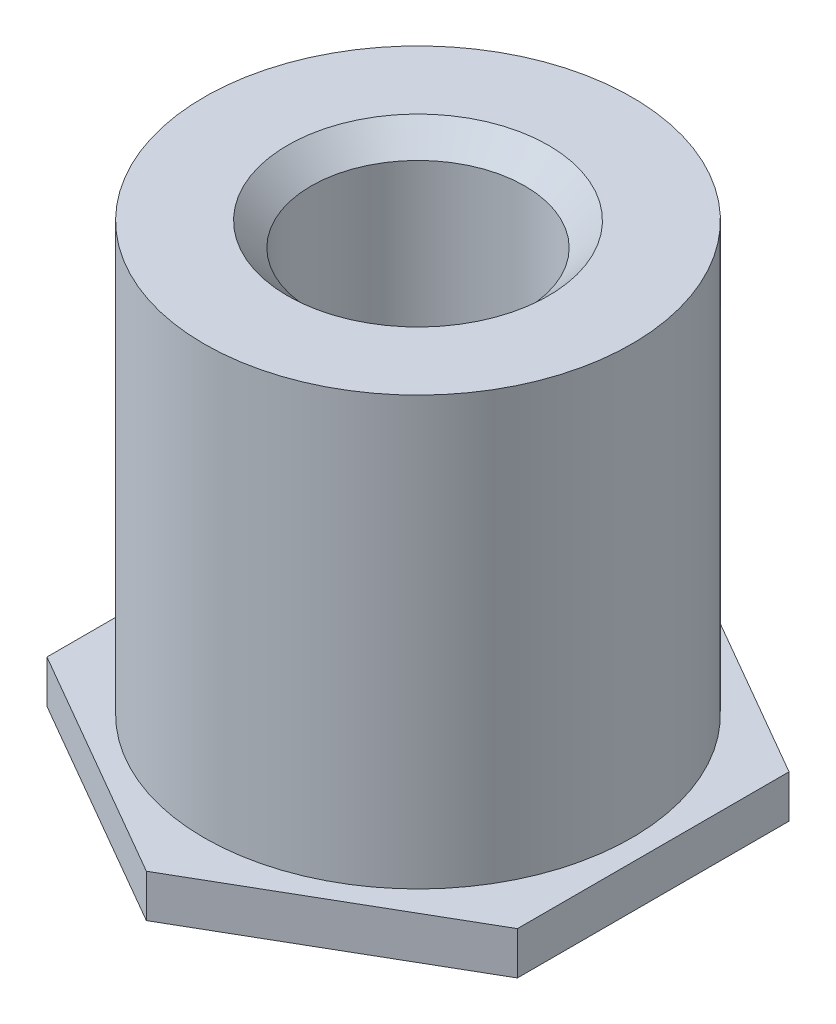
ISO-10303-21;
HEADER;
FILE_DESCRIPTION(('STEP AP214'),'2;1');
FILE_NAME('part.step','',(''),(''),'','','');
FILE_SCHEMA(('AUTOMOTIVE_DESIGN { 1 0 10303 214 1 1 1 1 }'));
ENDSEC;
DATA;
#1=APPLICATION_CONTEXT('core data for automotive mechanical design processes');
#2=APPLICATION_PROTOCOL_DEFINITION('international standard','automotive_design',2000,#1);
#3=PRODUCT_CONTEXT('',#1,'mechanical');
#4=PRODUCT('Part','Part','',(#3));
#5=PRODUCT_RELATED_PRODUCT_CATEGORY('part','',(#4));
#6=PRODUCT_DEFINITION_FORMATION('','',#4);
#7=PRODUCT_DEFINITION_CONTEXT('part definition',#1,'design');
#8=PRODUCT_DEFINITION('design','',#6,#7);
#9=PRODUCT_DEFINITION_SHAPE('','',#8);
#10=(LENGTH_UNIT() NAMED_UNIT(*) SI_UNIT(.MILLI.,.METRE.));
#11=(NAMED_UNIT(*) PLANE_ANGLE_UNIT() SI_UNIT($,.RADIAN.));
#12=(NAMED_UNIT(*) SI_UNIT($,.STERADIAN.) SOLID_ANGLE_UNIT());
#13=UNCERTAINTY_MEASURE_WITH_UNIT(LENGTH_MEASURE(1.E-05),#10,'distance_accuracy_value','');
#14=(GEOMETRIC_REPRESENTATION_CONTEXT(3) GLOBAL_UNCERTAINTY_ASSIGNED_CONTEXT((#13)) GLOBAL_UNIT_ASSIGNED_CONTEXT((#10,
#11,#12)) REPRESENTATION_CONTEXT('',''));
#15=CARTESIAN_POINT('',(0.,0.,0.));
#16=DIRECTION('',(0.,0.,1.));
#17=DIRECTION('',(1.,0.,0.));
#18=AXIS2_PLACEMENT_3D('',#15,#16,#17);
#19=CARTESIAN_POINT('',(-2.74999999999998,0.5,1.5877132402715));
#20=DIRECTION('',(0.499999999999995,0.,-0.866025403784442));
#21=DIRECTION('',(-0.866025403784442,0.,-0.499999999999995));
#22=AXIS2_PLACEMENT_3D('',#19,#20,#21);
#23=PLANE('',#22);
#24=DIRECTION('',(0.866025403784442,0.,0.499999999999995));
#25=VECTOR('',#24,1.);
#26=CARTESIAN_POINT('',(-2.74999999999998,0.,1.5877132402715));
#27=LINE('',#26,#25);
#28=CARTESIAN_POINT('',(-2.74999999999998,0.,1.5877132402715));
#29=VERTEX_POINT('',#28);
#30=CARTESIAN_POINT('',(0.,0.,3.17542648054294));
#31=VERTEX_POINT('',#30);
#32=EDGE_CURVE('E127',#29,#31,#27,.T.);
#33=ORIENTED_EDGE('',*,*,#32,.T.);
#34=DIRECTION('',(0.,-1.,0.));
#35=VECTOR('',#34,1.);
#36=CARTESIAN_POINT('',(0.,0.5,3.17542648054294));
#37=LINE('',#36,#35);
#38=CARTESIAN_POINT('',(0.,0.5,3.17542648054294));
#39=VERTEX_POINT('',#38);
#40=EDGE_CURVE('E42',#39,#31,#37,.T.);
#41=ORIENTED_EDGE('',*,*,#40,.F.);
#42=DIRECTION('',(0.866025403784442,0.,0.499999999999995));
#43=VECTOR('',#42,1.);
#44=CARTESIAN_POINT('',(-2.74999999999998,0.5,1.5877132402715));
#45=LINE('',#44,#43);
#46=CARTESIAN_POINT('',(-2.74999999999998,0.5,1.5877132402715));
#47=VERTEX_POINT('',#46);
#48=EDGE_CURVE('E138',#47,#39,#45,.T.);
#49=ORIENTED_EDGE('',*,*,#48,.F.);
#50=DIRECTION('',(0.,-1.,0.));
#51=VECTOR('',#50,1.);
#52=CARTESIAN_POINT('',(-2.74999999999998,0.5,1.5877132402715));
#53=LINE('',#52,#51);
#54=EDGE_CURVE('E123',#47,#29,#53,.T.);
#55=ORIENTED_EDGE('',*,*,#54,.T.);
#56=EDGE_LOOP('',(#33,#41,#49,#55));
#57=FACE_BOUND('',#56,.T.);
#58=ADVANCED_FACE('F39',(#57),#23,.F.);
#59=CARTESIAN_POINT('',(0.,0.5,3.17542648054294));
#60=DIRECTION('',(-0.500000000000001,0.,-0.866025403784438));
#61=DIRECTION('',(-0.866025403784438,0.,0.500000000000001));
#62=AXIS2_PLACEMENT_3D('',#59,#60,#61);
#63=PLANE('',#62);
#64=DIRECTION('',(0.866025403784438,0.,-0.500000000000001));
#65=VECTOR('',#64,1.);
#66=CARTESIAN_POINT('',(0.,0.,3.17542648054294));
#67=LINE('',#66,#65);
#68=CARTESIAN_POINT('',(2.75000000000001,0.,1.58771324027147));
#69=VERTEX_POINT('',#68);
#70=EDGE_CURVE('E130',#31,#69,#67,.T.);
#71=ORIENTED_EDGE('',*,*,#70,.T.);
#72=DIRECTION('',(0.,-1.,0.));
#73=VECTOR('',#72,1.);
#74=CARTESIAN_POINT('',(2.75000000000001,0.5,1.58771324027147));
#75=LINE('',#74,#73);
#76=CARTESIAN_POINT('',(2.75000000000001,0.5,1.58771324027147));
#77=VERTEX_POINT('',#76);
#78=EDGE_CURVE('E141',#77,#69,#75,.T.);
#79=ORIENTED_EDGE('',*,*,#78,.F.);
#80=DIRECTION('',(0.866025403784438,0.,-0.500000000000001));
#81=VECTOR('',#80,1.);
#82=CARTESIAN_POINT('',(0.,0.5,3.17542648054294));
#83=LINE('',#82,#81);
#84=EDGE_CURVE('E95',#39,#77,#83,.T.);
#85=ORIENTED_EDGE('',*,*,#84,.F.);
#86=ORIENTED_EDGE('',*,*,#40,.T.);
#87=EDGE_LOOP('',(#71,#79,#85,#86));
#88=FACE_BOUND('',#87,.T.);
#89=ADVANCED_FACE('F146',(#88),#63,.F.);
#90=CARTESIAN_POINT('',(2.75000000000001,0.5,1.58771324027147));
#91=DIRECTION('',(-1.,0.,0.));
#92=DIRECTION('',(0.,0.,1.));
#93=AXIS2_PLACEMENT_3D('',#90,#91,#92);
#94=PLANE('',#93);
#95=DIRECTION('',(0.,0.,-1.));
#96=VECTOR('',#95,1.);
#97=CARTESIAN_POINT('',(2.75000000000001,0.,1.58771324027147));
#98=LINE('',#97,#96);
#99=CARTESIAN_POINT('',(2.74999999999999,0.,-1.58771324027148));
#100=VERTEX_POINT('',#99);
#101=EDGE_CURVE('E133',#69,#100,#98,.T.);
#102=ORIENTED_EDGE('',*,*,#101,.T.);
#103=DIRECTION('',(0.,-1.,0.));
#104=VECTOR('',#103,1.);
#105=CARTESIAN_POINT('',(2.74999999999999,0.5,-1.58771324027148));
#106=LINE('',#105,#104);
#107=CARTESIAN_POINT('',(2.74999999999999,0.5,-1.58771324027148));
#108=VERTEX_POINT('',#107);
#109=EDGE_CURVE('E118',#108,#100,#106,.T.);
#110=ORIENTED_EDGE('',*,*,#109,.F.);
#111=DIRECTION('',(0.,0.,-1.));
#112=VECTOR('',#111,1.);
#113=CARTESIAN_POINT('',(2.75000000000001,0.5,1.58771324027147));
#114=LINE('',#113,#112);
#115=EDGE_CURVE('E109',#77,#108,#114,.T.);
#116=ORIENTED_EDGE('',*,*,#115,.F.);
#117=ORIENTED_EDGE('',*,*,#78,.T.);
#118=EDGE_LOOP('',(#102,#110,#116,#117));
#119=FACE_BOUND('',#118,.T.);
#120=ADVANCED_FACE('F152',(#119),#94,.F.);
#121=CARTESIAN_POINT('',(2.74999999999999,0.5,-1.58771324027148));
#122=DIRECTION('',(-0.499999999999995,0.,0.866025403784441));
#123=DIRECTION('',(0.866025403784442,0.,0.499999999999995));
#124=AXIS2_PLACEMENT_3D('',#121,#122,#123);
#125=PLANE('',#124);
#126=DIRECTION('',(-0.866025403784441,0.,-0.499999999999995));
#127=VECTOR('',#126,1.);
#128=CARTESIAN_POINT('',(2.74999999999999,0.,-1.58771324027148));
#129=LINE('',#128,#127);
#130=CARTESIAN_POINT('',(0.,0.,-3.17542648054294));
#131=VERTEX_POINT('',#130);
#132=EDGE_CURVE('E117',#100,#131,#129,.T.);
#133=ORIENTED_EDGE('',*,*,#132,.T.);
#134=DIRECTION('',(0.,-1.,0.));
#135=VECTOR('',#134,1.);
#136=CARTESIAN_POINT('',(0.,0.5,-3.17542648054294));
#137=LINE('',#136,#135);
#138=CARTESIAN_POINT('',(0.,0.5,-3.17542648054294));
#139=VERTEX_POINT('',#138);
#140=EDGE_CURVE('E114',#139,#131,#137,.T.);
#141=ORIENTED_EDGE('',*,*,#140,.F.);
#142=DIRECTION('',(-0.866025403784441,0.,-0.499999999999995));
#143=VECTOR('',#142,1.);
#144=CARTESIAN_POINT('',(2.74999999999999,0.5,-1.58771324027148));
#145=LINE('',#144,#143);
#146=EDGE_CURVE('E103',#108,#139,#145,.T.);
#147=ORIENTED_EDGE('',*,*,#146,.F.);
#148=ORIENTED_EDGE('',*,*,#109,.T.);
#149=EDGE_LOOP('',(#133,#141,#147,#148));
#150=FACE_BOUND('',#149,.T.);
#151=ADVANCED_FACE('F115',(#150),#125,.F.);
#152=CARTESIAN_POINT('',(0.,0.5,-3.17542648054294));
#153=DIRECTION('',(0.500000000000007,0.,0.866025403784435));
#154=DIRECTION('',(0.866025403784435,0.,-0.500000000000007));
#155=AXIS2_PLACEMENT_3D('',#152,#153,#154);
#156=PLANE('',#155);
#157=DIRECTION('',(-0.866025403784435,0.,0.500000000000007));
#158=VECTOR('',#157,1.);
#159=CARTESIAN_POINT('',(0.,0.,-3.17542648054294));
#160=LINE('',#159,#158);
#161=CARTESIAN_POINT('',(-2.75000000000002,0.,-1.58771324027145));
#162=VERTEX_POINT('',#161);
#163=EDGE_CURVE('E80',#131,#162,#160,.T.);
#164=ORIENTED_EDGE('',*,*,#163,.T.);
#165=DIRECTION('',(0.,-1.,0.));
#166=VECTOR('',#165,1.);
#167=CARTESIAN_POINT('',(-2.75000000000002,0.5,-1.58771324027145));
#168=LINE('',#167,#166);
#169=CARTESIAN_POINT('',(-2.75000000000002,0.5,-1.58771324027145));
#170=VERTEX_POINT('',#169);
#171=EDGE_CURVE('E119',#170,#162,#168,.T.);
#172=ORIENTED_EDGE('',*,*,#171,.F.);
#173=DIRECTION('',(-0.866025403784435,0.,0.500000000000007));
#174=VECTOR('',#173,1.);
#175=CARTESIAN_POINT('',(0.,0.5,-3.17542648054294));
#176=LINE('',#175,#174);
#177=EDGE_CURVE('E107',#139,#170,#176,.T.);
#178=ORIENTED_EDGE('',*,*,#177,.F.);
#179=ORIENTED_EDGE('',*,*,#140,.T.);
#180=EDGE_LOOP('',(#164,#172,#178,#179));
#181=FACE_BOUND('',#180,.T.);
#182=ADVANCED_FACE('F121',(#181),#156,.F.);
#183=CARTESIAN_POINT('',(-2.75000000000002,0.5,-1.58771324027145));
#184=DIRECTION('',(1.,0.,0.));
#185=DIRECTION('',(0.,0.,-1.));
#186=AXIS2_PLACEMENT_3D('',#183,#184,#185);
#187=PLANE('',#186);
#188=DIRECTION('',(0.,0.,1.));
#189=VECTOR('',#188,1.);
#190=CARTESIAN_POINT('',(-2.75000000000002,0.,-1.58771324027145));
#191=LINE('',#190,#189);
#192=EDGE_CURVE('E86',#162,#29,#191,.T.);
#193=ORIENTED_EDGE('',*,*,#192,.T.);
#194=ORIENTED_EDGE('',*,*,#54,.F.);
#195=DIRECTION('',(0.,0.,1.));
#196=VECTOR('',#195,1.);
#197=CARTESIAN_POINT('',(-2.75000000000002,0.5,-1.58771324027145));
#198=LINE('',#197,#196);
#199=EDGE_CURVE('E56',#170,#47,#198,.T.);
#200=ORIENTED_EDGE('',*,*,#199,.F.);
#201=ORIENTED_EDGE('',*,*,#171,.T.);
#202=EDGE_LOOP('',(#193,#194,#200,#201));
#203=FACE_BOUND('',#202,.T.);
#204=ADVANCED_FACE('F184',(#203),#187,.F.);
#205=CARTESIAN_POINT('',(0.,0.5,0.));
#206=DIRECTION('',(0.,1.,0.));
#207=DIRECTION('',(0.,0.,1.));
#208=AXIS2_PLACEMENT_3D('',#205,#206,#207);
#209=PLANE('',#208);
#210=CARTESIAN_POINT('',(0.,0.5,0.));
#211=DIRECTION('',(0.,1.,0.));
#212=DIRECTION('',(0.,0.,1.));
#213=AXIS2_PLACEMENT_3D('',#210,#211,#212);
#214=CIRCLE('',#213,2.5);
#215=CARTESIAN_POINT('',(0.,0.5,2.5));
#216=VERTEX_POINT('',#215);
#217=EDGE_CURVE('E11',#216,#216,#214,.T.);
#218=ORIENTED_EDGE('',*,*,#217,.F.);
#219=EDGE_LOOP('',(#218));
#220=FACE_BOUND('',#219,.T.);
#221=ORIENTED_EDGE('',*,*,#48,.T.);
#222=ORIENTED_EDGE('',*,*,#84,.T.);
#223=ORIENTED_EDGE('',*,*,#115,.T.);
#224=ORIENTED_EDGE('',*,*,#146,.T.);
#225=ORIENTED_EDGE('',*,*,#177,.T.);
#226=ORIENTED_EDGE('',*,*,#199,.T.);
#227=EDGE_LOOP('',(#221,#222,#223,#224,#225,#226));
#228=FACE_BOUND('',#227,.T.);
#229=ADVANCED_FACE('F105',(#220,#228),#209,.T.);
#230=CARTESIAN_POINT('',(0.,0.,0.));
#231=DIRECTION('',(0.,1.,0.));
#232=DIRECTION('',(0.,0.,1.));
#233=AXIS2_PLACEMENT_3D('',#230,#231,#232);
#234=PLANE('',#233);
#235=ORIENTED_EDGE('',*,*,#32,.F.);
#236=ORIENTED_EDGE('',*,*,#192,.F.);
#237=ORIENTED_EDGE('',*,*,#163,.F.);
#238=ORIENTED_EDGE('',*,*,#132,.F.);
#239=ORIENTED_EDGE('',*,*,#101,.F.);
#240=ORIENTED_EDGE('',*,*,#70,.F.);
#241=EDGE_LOOP('',(#235,#236,#237,#238,#239,#240));
#242=FACE_BOUND('',#241,.T.);
#243=ADVANCED_FACE('F151',(#242),#234,.F.);
#244=CARTESIAN_POINT('',(0.,5.5,0.));
#245=DIRECTION('',(0.,-1.,0.));
#246=DIRECTION('',(0.,0.,-1.));
#247=AXIS2_PLACEMENT_3D('',#244,#245,#246);
#248=CYLINDRICAL_SURFACE('',#247,2.5);
#249=CARTESIAN_POINT('',(0.,5.5,0.));
#250=DIRECTION('',(0.,1.,0.));
#251=DIRECTION('',(0.,0.,1.));
#252=AXIS2_PLACEMENT_3D('',#249,#250,#251);
#253=CIRCLE('',#252,2.5);
#254=CARTESIAN_POINT('',(0.,5.5,2.5));
#255=VERTEX_POINT('',#254);
#256=EDGE_CURVE('E131',#255,#255,#253,.T.);
#257=ORIENTED_EDGE('',*,*,#256,.F.);
#258=EDGE_LOOP('',(#257));
#259=FACE_BOUND('',#258,.T.);
#260=ORIENTED_EDGE('',*,*,#217,.T.);
#261=EDGE_LOOP('',(#260));
#262=FACE_BOUND('',#261,.T.);
#263=ADVANCED_FACE('F174',(#259,#262),#248,.T.);
#264=CARTESIAN_POINT('',(0.,5.5,0.));
#265=DIRECTION('',(0.,1.,0.));
#266=DIRECTION('',(0.,0.,1.));
#267=AXIS2_PLACEMENT_3D('',#264,#265,#266);
#268=PLANE('',#267);
#269=CARTESIAN_POINT('',(0.,5.5,0.));
#270=DIRECTION('',(0.,1.,0.));
#271=DIRECTION('',(0.,0.,1.));
#272=AXIS2_PLACEMENT_3D('',#269,#270,#271);
#273=CIRCLE('',#272,1.525);
#274=CARTESIAN_POINT('',(0.,5.5,1.525));
#275=VERTEX_POINT('',#274);
#276=EDGE_CURVE('E164',#275,#275,#273,.T.);
#277=ORIENTED_EDGE('',*,*,#276,.F.);
#278=EDGE_LOOP('',(#277));
#279=FACE_BOUND('',#278,.T.);
#280=ORIENTED_EDGE('',*,*,#256,.T.);
#281=EDGE_LOOP('',(#280));
#282=FACE_BOUND('',#281,.T.);
#283=ADVANCED_FACE('F170',(#279,#282),#268,.T.);
#284=CARTESIAN_POINT('',(0.,1.5,0.));
#285=DIRECTION('',(0.,1.,0.));
#286=DIRECTION('',(0.,0.,1.));
#287=AXIS2_PLACEMENT_3D('',#284,#285,#286);
#288=CONICAL_SURFACE('',#287,1.25,1.02974425867665);
#289=CARTESIAN_POINT('',(0.,0.74892422621555,0.));
#290=VERTEX_POINT('',#289);
#291=VERTEX_LOOP('',#290);
#292=FACE_BOUND('',#291,.T.);
#293=CARTESIAN_POINT('',(0.,1.5,0.));
#294=DIRECTION('',(0.,1.,0.));
#295=DIRECTION('',(0.,0.,1.));
#296=AXIS2_PLACEMENT_3D('',#293,#294,#295);
#297=CIRCLE('',#296,1.25);
#298=CARTESIAN_POINT('',(0.,1.5,1.25));
#299=VERTEX_POINT('',#298);
#300=EDGE_CURVE('E158',#299,#299,#297,.T.);
#301=ORIENTED_EDGE('',*,*,#300,.T.);
#302=EDGE_LOOP('',(#301));
#303=FACE_BOUND('',#302,.T.);
#304=ADVANCED_FACE('F173',(#292,#303),#288,.F.);
#305=CARTESIAN_POINT('',(0.,5.5,0.));
#306=DIRECTION('',(0.,1.,0.));
#307=DIRECTION('',(0.,0.,1.));
#308=AXIS2_PLACEMENT_3D('',#305,#306,#307);
#309=CYLINDRICAL_SURFACE('',#308,1.25);
#310=ORIENTED_EDGE('',*,*,#300,.F.);
#311=EDGE_LOOP('',(#310));
#312=FACE_BOUND('',#311,.T.);
#313=CARTESIAN_POINT('',(0.,5.225,0.));
#314=DIRECTION('',(0.,1.,0.));
#315=DIRECTION('',(0.,0.,1.));
#316=AXIS2_PLACEMENT_3D('',#313,#314,#315);
#317=CIRCLE('',#316,1.25);
#318=CARTESIAN_POINT('',(0.,5.225,1.25));
#319=VERTEX_POINT('',#318);
#320=EDGE_CURVE('E161',#319,#319,#317,.T.);
#321=ORIENTED_EDGE('',*,*,#320,.T.);
#322=EDGE_LOOP('',(#321));
#323=FACE_BOUND('',#322,.T.);
#324=ADVANCED_FACE('F243',(#312,#323),#309,.F.);
#325=CARTESIAN_POINT('',(0.,5.5,0.));
#326=DIRECTION('',(0.,1.,0.));
#327=DIRECTION('',(0.,0.,1.));
#328=AXIS2_PLACEMENT_3D('',#325,#326,#327);
#329=CONICAL_SURFACE('',#328,1.525,0.785398163397448);
#330=ORIENTED_EDGE('',*,*,#320,.F.);
#331=EDGE_LOOP('',(#330));
#332=FACE_BOUND('',#331,.T.);
#333=ORIENTED_EDGE('',*,*,#276,.T.);
#334=EDGE_LOOP('',(#333));
#335=FACE_BOUND('',#334,.T.);
#336=ADVANCED_FACE('F168',(#332,#335),#329,.F.);
#337=CLOSED_SHELL('',(#58,#89,#120,#151,#182,#204,#229,#243,#263,#283,#304,#324,#336));
#338=MANIFOLD_SOLID_BREP('B2',#337);
#339=ADVANCED_BREP_SHAPE_REPRESENTATION('',(#18,#338),#14);
#340=SHAPE_DEFINITION_REPRESENTATION(#9,#339);
ENDSEC;
END-ISO-10303-21;
